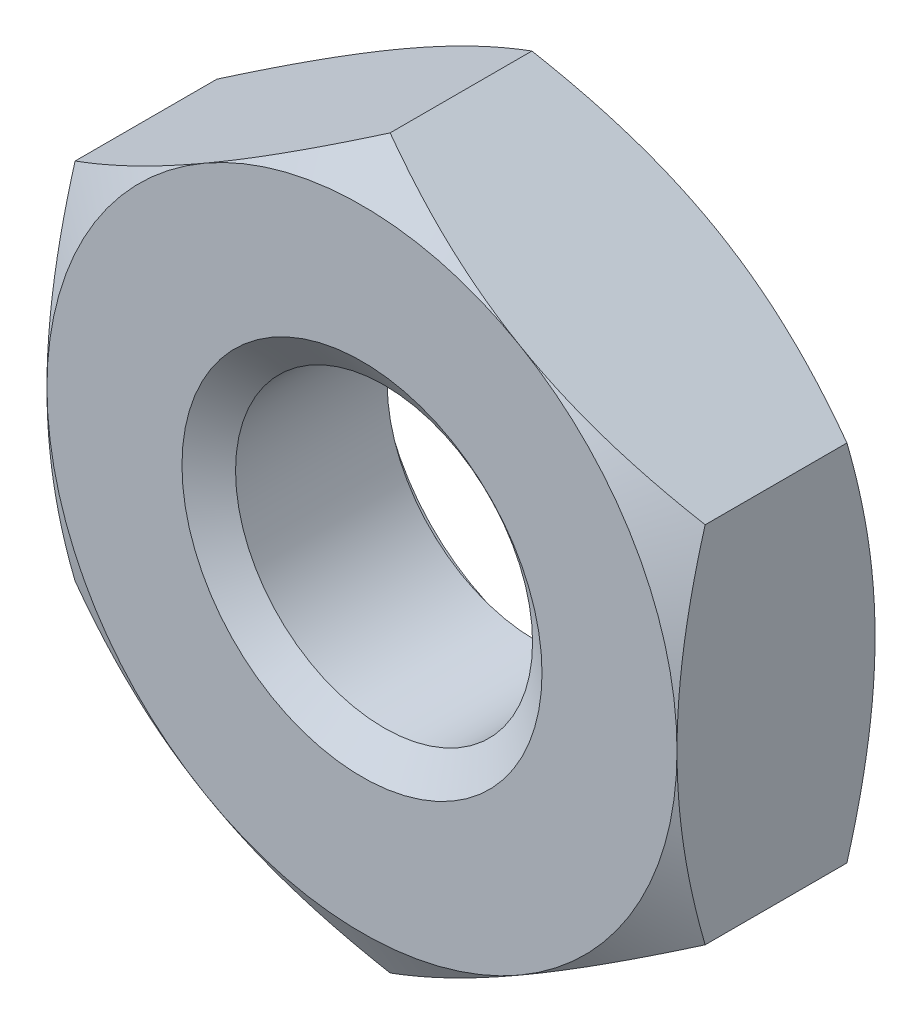
ISO-10303-21;
HEADER;
FILE_DESCRIPTION(('STEP AP214'),'2;1');
FILE_NAME('part.step','',(''),(''),'','','');
FILE_SCHEMA(('AUTOMOTIVE_DESIGN { 1 0 10303 214 1 1 1 1 }'));
ENDSEC;
DATA;
#1=APPLICATION_CONTEXT('core data for automotive mechanical design processes');
#2=APPLICATION_PROTOCOL_DEFINITION('international standard','automotive_design',2000,#1);
#3=PRODUCT_CONTEXT('',#1,'mechanical');
#4=PRODUCT('Part','Part','',(#3));
#5=PRODUCT_RELATED_PRODUCT_CATEGORY('part','',(#4));
#6=PRODUCT_DEFINITION_FORMATION('','',#4);
#7=PRODUCT_DEFINITION_CONTEXT('part definition',#1,'design');
#8=PRODUCT_DEFINITION('design','',#6,#7);
#9=PRODUCT_DEFINITION_SHAPE('','',#8);
#10=(LENGTH_UNIT() NAMED_UNIT(*) SI_UNIT(.MILLI.,.METRE.));
#11=(NAMED_UNIT(*) PLANE_ANGLE_UNIT() SI_UNIT($,.RADIAN.));
#12=(NAMED_UNIT(*) SI_UNIT($,.STERADIAN.) SOLID_ANGLE_UNIT());
#13=UNCERTAINTY_MEASURE_WITH_UNIT(LENGTH_MEASURE(1.E-05),#10,'distance_accuracy_value','');
#14=(GEOMETRIC_REPRESENTATION_CONTEXT(3) GLOBAL_UNCERTAINTY_ASSIGNED_CONTEXT((#13)) GLOBAL_UNIT_ASSIGNED_CONTEXT((#10,
#11,#12)) REPRESENTATION_CONTEXT('',''));
#15=CARTESIAN_POINT('',(0.,0.,0.));
#16=DIRECTION('',(0.,0.,1.));
#17=DIRECTION('',(1.,0.,0.));
#18=AXIS2_PLACEMENT_3D('',#15,#16,#17);
#19=CARTESIAN_POINT('',(0.,0.,-2.2));
#20=DIRECTION('',(0.,0.,1.));
#21=DIRECTION('',(1.,0.,0.));
#22=AXIS2_PLACEMENT_3D('',#19,#20,#21);
#23=CYLINDRICAL_SURFACE('',#22,1.65);
#24=CARTESIAN_POINT('',(0.,0.,-0.245072638373396));
#25=DIRECTION('',(0.,0.,1.));
#26=DIRECTION('',(1.,0.,0.));
#27=AXIS2_PLACEMENT_3D('',#24,#25,#26);
#28=CIRCLE('',#27,1.65);
#29=CARTESIAN_POINT('',(1.65,0.,-0.245072638373396));
#30=VERTEX_POINT('',#29);
#31=EDGE_CURVE('E175',#30,#30,#28,.F.);
#32=ORIENTED_EDGE('',*,*,#31,.F.);
#33=EDGE_LOOP('',(#32));
#34=FACE_BOUND('',#33,.T.);
#35=CARTESIAN_POINT('',(0.,0.,-1.9295273616266));
#36=DIRECTION('',(0.,0.,-1.));
#37=DIRECTION('',(-1.,0.,0.));
#38=AXIS2_PLACEMENT_3D('',#35,#36,#37);
#39=CIRCLE('',#38,1.65);
#40=CARTESIAN_POINT('',(-1.65,0.,-1.9295273616266));
#41=VERTEX_POINT('',#40);
#42=EDGE_CURVE('E40',#41,#41,#39,.F.);
#43=ORIENTED_EDGE('',*,*,#42,.F.);
#44=EDGE_LOOP('',(#43));
#45=FACE_BOUND('',#44,.T.);
#46=ADVANCED_FACE('F35',(#34,#45),#23,.F.);
#47=CARTESIAN_POINT('',(0.,4.04145188432739,-2.2));
#48=DIRECTION('',(0.,0.,-1.));
#49=DIRECTION('',(-1.,0.,0.));
#50=AXIS2_PLACEMENT_3D('',#47,#48,#49);
#51=PLANE('',#50);
#52=CARTESIAN_POINT('',(0.,0.,-2.2));
#53=DIRECTION('',(0.,0.,-1.));
#54=DIRECTION('',(-1.,0.,0.));
#55=AXIS2_PLACEMENT_3D('',#52,#53,#54);
#56=CIRCLE('',#55,3.5);
#57=CARTESIAN_POINT('',(-3.5,0.,-2.2));
#58=VERTEX_POINT('',#57);
#59=CARTESIAN_POINT('',(-1.75000000000002,-3.03108891324552,-2.2));
#60=VERTEX_POINT('',#59);
#61=EDGE_CURVE('E171',#58,#60,#56,.F.);
#62=ORIENTED_EDGE('',*,*,#61,.F.);
#63=CARTESIAN_POINT('',(-1.75000000000001,3.03108891324553,-2.2));
#64=VERTEX_POINT('',#63);
#65=EDGE_CURVE('E153',#64,#58,#56,.F.);
#66=ORIENTED_EDGE('',*,*,#65,.F.);
#67=CARTESIAN_POINT('',(1.75000000000002,3.03108891324552,-2.2));
#68=VERTEX_POINT('',#67);
#69=EDGE_CURVE('E170',#68,#64,#56,.F.);
#70=ORIENTED_EDGE('',*,*,#69,.F.);
#71=CARTESIAN_POINT('',(0.,0.,-2.2));
#72=DIRECTION('',(0.,0.,1.));
#73=DIRECTION('',(1.,0.,0.));
#74=AXIS2_PLACEMENT_3D('',#71,#72,#73);
#75=CIRCLE('',#74,3.5);
#76=CARTESIAN_POINT('',(3.5,0.,-2.2));
#77=VERTEX_POINT('',#76);
#78=EDGE_CURVE('E245',#77,#68,#75,.T.);
#79=ORIENTED_EDGE('',*,*,#78,.F.);
#80=CARTESIAN_POINT('',(1.75000000000001,-3.03108891324553,-2.2));
#81=VERTEX_POINT('',#80);
#82=EDGE_CURVE('E361',#81,#77,#56,.F.);
#83=ORIENTED_EDGE('',*,*,#82,.F.);
#84=EDGE_CURVE('E365',#60,#81,#56,.F.);
#85=ORIENTED_EDGE('',*,*,#84,.F.);
#86=EDGE_LOOP('',(#62,#66,#70,#79,#83,#85));
#87=FACE_BOUND('',#86,.T.);
#88=CARTESIAN_POINT('',(0.,0.,-2.2));
#89=DIRECTION('',(0.,0.,-1.));
#90=DIRECTION('',(-1.,0.,0.));
#91=AXIS2_PLACEMENT_3D('',#88,#89,#90);
#92=CIRCLE('',#91,2.);
#93=CARTESIAN_POINT('',(-2.,0.,-2.2));
#94=VERTEX_POINT('',#93);
#95=EDGE_CURVE('E178',#94,#94,#92,.F.);
#96=ORIENTED_EDGE('',*,*,#95,.T.);
#97=EDGE_LOOP('',(#96));
#98=FACE_BOUND('',#97,.T.);
#99=ADVANCED_FACE('F298',(#87,#98),#51,.T.);
#100=CARTESIAN_POINT('',(0.,4.04145188432739,0.));
#101=DIRECTION('',(0.,0.,-1.));
#102=DIRECTION('',(-1.,0.,0.));
#103=AXIS2_PLACEMENT_3D('',#100,#101,#102);
#104=PLANE('',#103);
#105=CARTESIAN_POINT('',(0.,0.,0.));
#106=DIRECTION('',(0.,0.,-1.));
#107=DIRECTION('',(-1.,0.,0.));
#108=AXIS2_PLACEMENT_3D('',#105,#106,#107);
#109=CIRCLE('',#108,3.5);
#110=CARTESIAN_POINT('',(-3.5,0.,0.));
#111=VERTEX_POINT('',#110);
#112=CARTESIAN_POINT('',(-1.75000000000001,3.03108891324553,0.));
#113=VERTEX_POINT('',#112);
#114=EDGE_CURVE('E11',#111,#113,#109,.T.);
#115=ORIENTED_EDGE('',*,*,#114,.F.);
#116=CARTESIAN_POINT('',(-1.75000000000002,-3.03108891324552,0.));
#117=VERTEX_POINT('',#116);
#118=EDGE_CURVE('E47',#117,#111,#109,.T.);
#119=ORIENTED_EDGE('',*,*,#118,.F.);
#120=CARTESIAN_POINT('',(1.75000000000001,-3.03108891324553,0.));
#121=VERTEX_POINT('',#120);
#122=EDGE_CURVE('E174',#121,#117,#109,.T.);
#123=ORIENTED_EDGE('',*,*,#122,.F.);
#124=CARTESIAN_POINT('',(3.5,0.,0.));
#125=VERTEX_POINT('',#124);
#126=EDGE_CURVE('E352',#125,#121,#109,.T.);
#127=ORIENTED_EDGE('',*,*,#126,.F.);
#128=CARTESIAN_POINT('',(0.,0.,0.));
#129=DIRECTION('',(0.,0.,1.));
#130=DIRECTION('',(1.,0.,0.));
#131=AXIS2_PLACEMENT_3D('',#128,#129,#130);
#132=CIRCLE('',#131,3.5);
#133=CARTESIAN_POINT('',(1.75000000000002,3.03108891324552,0.));
#134=VERTEX_POINT('',#133);
#135=EDGE_CURVE('E129',#125,#134,#132,.T.);
#136=ORIENTED_EDGE('',*,*,#135,.T.);
#137=EDGE_CURVE('E45',#113,#134,#109,.T.);
#138=ORIENTED_EDGE('',*,*,#137,.F.);
#139=EDGE_LOOP('',(#115,#119,#123,#127,#136,#138));
#140=FACE_BOUND('',#139,.T.);
#141=CARTESIAN_POINT('',(0.,0.,0.));
#142=DIRECTION('',(0.,0.,1.));
#143=DIRECTION('',(1.,0.,0.));
#144=AXIS2_PLACEMENT_3D('',#141,#142,#143);
#145=CIRCLE('',#144,2.);
#146=CARTESIAN_POINT('',(2.,0.,0.));
#147=VERTEX_POINT('',#146);
#148=EDGE_CURVE('E177',#147,#147,#145,.T.);
#149=ORIENTED_EDGE('',*,*,#148,.F.);
#150=EDGE_LOOP('',(#149));
#151=FACE_BOUND('',#150,.T.);
#152=ADVANCED_FACE('F250',(#140,#151),#104,.F.);
#153=CARTESIAN_POINT('',(0.,4.04145188432739,-2.2));
#154=DIRECTION('',(-0.500000000000003,0.866025403784437,0.));
#155=DIRECTION('',(-0.866025403784437,-0.500000000000003,0.));
#156=AXIS2_PLACEMENT_3D('',#153,#154,#155);
#157=PLANE('',#156);
#158=DIRECTION('',(0.,0.,1.));
#159=VECTOR('',#158,1.);
#160=CARTESIAN_POINT('',(-3.5,2.02072594216368,-2.2));
#161=LINE('',#160,#159);
#162=CARTESIAN_POINT('',(-3.5,2.02072594216372,-1.88739260883035));
#163=VERTEX_POINT('',#162);
#164=CARTESIAN_POINT('',(-3.5,2.02072594216368,-0.312607391169644));
#165=VERTEX_POINT('',#164);
#166=EDGE_CURVE('E165',#163,#165,#161,.T.);
#167=ORIENTED_EDGE('',*,*,#166,.T.);
#168=CARTESIAN_POINT('',(-3.5002,2.02061047210984,-0.312674060693373));
#169=CARTESIAN_POINT('',(-3.34639282154755,2.10941108799266,-0.261385788989984));
#170=CARTESIAN_POINT('',(-3.19125798916558,2.19897822522908,-0.214740953816197));
#171=CARTESIAN_POINT('',(-2.87830199342322,2.37966345361544,-0.133321875533348));
#172=CARTESIAN_POINT('',(-2.7204752692125,2.47078475532382,-0.0985764355845608));
#173=CARTESIAN_POINT('',(-2.40677778961987,2.65189807961073,-0.0444900271828354));
#174=CARTESIAN_POINT('',(-2.25095530083931,2.74186223545399,-0.0247890862603808));
#175=CARTESIAN_POINT('',(-1.93857711279463,2.92221386641055,-0.00127013273725375));
#176=CARTESIAN_POINT('',(-1.78202254896577,3.01260068598001,0.00256735545443527));
#177=CARTESIAN_POINT('',(-1.48949078007901,3.1814939814933,-0.00541530187697797));
#178=CARTESIAN_POINT('',(-1.35346978754209,3.26002573814993,-0.0152754340696081));
#179=CARTESIAN_POINT('',(-1.082313979711,3.41657761679354,-0.0465264668994061));
#180=CARTESIAN_POINT('',(-0.947180102315315,3.49459719728458,-0.0679280432858016));
#181=CARTESIAN_POINT('',(-0.675465207594812,3.65147186489429,-0.121430407880583));
#182=CARTESIAN_POINT('',(-0.538918580721659,3.73030709667644,-0.153757994445094));
#183=CARTESIAN_POINT('',(-0.267861907055491,3.88680174018325,-0.227128933808004));
#184=CARTESIAN_POINT('',(-0.133348387531455,3.9644631568901,-0.268155046569877));
#185=CARTESIAN_POINT('',(0.000200000000008977,4.04156735438123,-0.312674060693383));
#186=B_SPLINE_CURVE_WITH_KNOTS('',3,(#168,#169,#170,#171,#172,#173,#174,#175,#176,#177,#178,
#179,#180,#181,#182,#183,#184,#185),.UNSPECIFIED.,.F.,.F.,(4,2,2,2,2,2,2,2,4),(0.,
0.554793832886255,1.11092123814984,1.65328467083219,2.19498204478403,2.66665130850861,
3.13875761298268,3.62133612600511,4.10296698719189),.UNSPECIFIED.);
#187=EDGE_CURVE('E134',#165,#113,#186,.T.);
#188=ORIENTED_EDGE('',*,*,#187,.T.);
#189=CARTESIAN_POINT('',(0.,4.04145188432739,-0.312607391169655));
#190=VERTEX_POINT('',#189);
#191=EDGE_CURVE('E54',#113,#190,#186,.T.);
#192=ORIENTED_EDGE('',*,*,#191,.T.);
#193=DIRECTION('',(0.,0.,1.));
#194=VECTOR('',#193,1.);
#195=CARTESIAN_POINT('',(0.,4.04145188432739,-2.2));
#196=LINE('',#195,#194);
#197=CARTESIAN_POINT('',(0.,4.04145188432739,-1.88739260883035));
#198=VERTEX_POINT('',#197);
#199=EDGE_CURVE('E150',#198,#190,#196,.T.);
#200=ORIENTED_EDGE('',*,*,#199,.F.);
#201=CARTESIAN_POINT('',(-3.5002,2.02061047210984,-1.88732593930663));
#202=CARTESIAN_POINT('',(-3.34639282154755,2.10941108799266,-1.93861421101002));
#203=CARTESIAN_POINT('',(-3.19125798916558,2.19897822522908,-1.9852590461838));
#204=CARTESIAN_POINT('',(-2.87830199342322,2.37966345361544,-2.06667812446665));
#205=CARTESIAN_POINT('',(-2.7204752692125,2.47078475532382,-2.10142356441544));
#206=CARTESIAN_POINT('',(-2.40677778961987,2.65189807961073,-2.15550997281717));
#207=CARTESIAN_POINT('',(-2.25095530083931,2.74186223545399,-2.17521091373962));
#208=CARTESIAN_POINT('',(-1.93857711279463,2.92221386641055,-2.19872986726275));
#209=CARTESIAN_POINT('',(-1.78202254896577,3.01260068598001,-2.20256735545444));
#210=CARTESIAN_POINT('',(-1.48949078007901,3.1814939814933,-2.19458469812302));
#211=CARTESIAN_POINT('',(-1.35346978754209,3.26002573814993,-2.18472456593039));
#212=CARTESIAN_POINT('',(-1.082313979711,3.41657761679354,-2.15347353310059));
#213=CARTESIAN_POINT('',(-0.947180102315315,3.49459719728458,-2.1320719567142));
#214=CARTESIAN_POINT('',(-0.675465207594812,3.65147186489429,-2.07856959211942));
#215=CARTESIAN_POINT('',(-0.538918580721659,3.73030709667644,-2.04624200555491));
#216=CARTESIAN_POINT('',(-0.267861907055491,3.88680174018325,-1.972871066192));
#217=CARTESIAN_POINT('',(-0.133348387531455,3.9644631568901,-1.93184495343012));
#218=CARTESIAN_POINT('',(0.000200000000009136,4.04156735438123,-1.88732593930662));
#219=B_SPLINE_CURVE_WITH_KNOTS('',3,(#201,#202,#203,#204,#205,#206,#207,#208,#209,#210,#211,
#212,#213,#214,#215,#216,#217,#218),.UNSPECIFIED.,.F.,.F.,(4,2,2,2,2,2,2,2,4),(0.,
0.554793832886255,1.11092123814984,1.65328467083219,2.19498204478403,2.66665130850861,
3.13875761298268,3.62133612600511,4.10296698719189),.UNSPECIFIED.);
#220=EDGE_CURVE('E168',#64,#198,#219,.T.);
#221=ORIENTED_EDGE('',*,*,#220,.F.);
#222=EDGE_CURVE('E260',#163,#64,#219,.T.);
#223=ORIENTED_EDGE('',*,*,#222,.F.);
#224=EDGE_LOOP('',(#167,#188,#192,#200,#221,#223));
#225=FACE_BOUND('',#224,.T.);
#226=ADVANCED_FACE('F37',(#225),#157,.T.);
#227=CARTESIAN_POINT('',(3.5,2.02072594216367,-2.2));
#228=DIRECTION('',(0.500000000000007,0.866025403784435,0.));
#229=DIRECTION('',(-0.866025403784435,0.500000000000007,0.));
#230=AXIS2_PLACEMENT_3D('',#227,#228,#229);
#231=PLANE('',#230);
#232=ORIENTED_EDGE('',*,*,#199,.T.);
#233=CARTESIAN_POINT('',(-0.000199999999990868,4.04156735438123,-0.312674060693383));
#234=CARTESIAN_POINT('',(0.153607178452459,3.95276673849841,-0.261385788989994));
#235=CARTESIAN_POINT('',(0.308742010834433,3.86319960126199,-0.214740953816206));
#236=CARTESIAN_POINT('',(0.621698006576791,3.68251437287563,-0.133321875533355));
#237=CARTESIAN_POINT('',(0.779524730787505,3.59139307116725,-0.0985764355845671));
#238=CARTESIAN_POINT('',(1.09322221038014,3.41027974688034,-0.0444900271828396));
#239=CARTESIAN_POINT('',(1.2490446991607,3.32031559103708,-0.024789086260384));
#240=CARTESIAN_POINT('',(1.56142288720538,3.13996396008051,-0.00127013273725514));
#241=CARTESIAN_POINT('',(1.71797745103424,3.04957714051106,0.00256735545443454));
#242=CARTESIAN_POINT('',(2.010509219921,2.88068384499776,-0.00541530187697728));
#243=CARTESIAN_POINT('',(2.14653021245792,2.80215208834113,-0.0152754340696065));
#244=CARTESIAN_POINT('',(2.417686020289,2.64560020969752,-0.0465264668994028));
#245=CARTESIAN_POINT('',(2.55281989768469,2.56758062920648,-0.0679280432857974));
#246=CARTESIAN_POINT('',(2.82453479240519,2.41070596159677,-0.121430407880576));
#247=CARTESIAN_POINT('',(2.96108141927834,2.33187072981462,-0.153757994445086));
#248=CARTESIAN_POINT('',(3.23213809294451,2.17537608630781,-0.227128933807994));
#249=CARTESIAN_POINT('',(3.36665161246854,2.09771466960096,-0.268155046569867));
#250=CARTESIAN_POINT('',(3.5002,2.02061047210983,-0.312674060693371));
#251=B_SPLINE_CURVE_WITH_KNOTS('',3,(#233,#234,#235,#236,#237,#238,#239,#240,#241,#242,#243,
#244,#245,#246,#247,#248,#249,#250),.UNSPECIFIED.,.F.,.F.,(4,2,2,2,2,2,2,2,4),(0.,
0.554793832886257,1.11092123814984,1.6532846708322,2.19498204478404,2.66665130850861,
3.13875761298268,3.62133612600511,4.10296698719189),.UNSPECIFIED.);
#252=EDGE_CURVE('E144',#190,#134,#251,.T.);
#253=ORIENTED_EDGE('',*,*,#252,.T.);
#254=CARTESIAN_POINT('',(3.5,2.02072594216371,-0.312607391169655));
#255=VERTEX_POINT('',#254);
#256=EDGE_CURVE('E61',#134,#255,#251,.T.);
#257=ORIENTED_EDGE('',*,*,#256,.T.);
#258=DIRECTION('',(0.,0.,1.));
#259=VECTOR('',#258,1.);
#260=CARTESIAN_POINT('',(3.5,2.02072594216367,-2.2));
#261=LINE('',#260,#259);
#262=CARTESIAN_POINT('',(3.5,2.02072594216371,-1.88739260883035));
#263=VERTEX_POINT('',#262);
#264=EDGE_CURVE('E143',#263,#255,#261,.T.);
#265=ORIENTED_EDGE('',*,*,#264,.F.);
#266=CARTESIAN_POINT('',(-0.000199999999990853,4.04156735438123,-1.88732593930662));
#267=CARTESIAN_POINT('',(0.153607178452459,3.95276673849841,-1.93861421101001));
#268=CARTESIAN_POINT('',(0.308742010834433,3.86319960126199,-1.98525904618379));
#269=CARTESIAN_POINT('',(0.621698006576791,3.68251437287563,-2.06667812446665));
#270=CARTESIAN_POINT('',(0.779524730787505,3.59139307116725,-2.10142356441543));
#271=CARTESIAN_POINT('',(1.09322221038014,3.41027974688034,-2.15550997281716));
#272=CARTESIAN_POINT('',(1.2490446991607,3.32031559103708,-2.17521091373962));
#273=CARTESIAN_POINT('',(1.56142288720538,3.13996396008051,-2.19872986726275));
#274=CARTESIAN_POINT('',(1.71797745103424,3.04957714051106,-2.20256735545444));
#275=CARTESIAN_POINT('',(2.010509219921,2.88068384499776,-2.19458469812302));
#276=CARTESIAN_POINT('',(2.14653021245792,2.80215208834113,-2.18472456593039));
#277=CARTESIAN_POINT('',(2.417686020289,2.64560020969752,-2.1534735331006));
#278=CARTESIAN_POINT('',(2.55281989768469,2.56758062920648,-2.1320719567142));
#279=CARTESIAN_POINT('',(2.82453479240519,2.41070596159677,-2.07856959211942));
#280=CARTESIAN_POINT('',(2.96108141927834,2.33187072981462,-2.04624200555491));
#281=CARTESIAN_POINT('',(3.23213809294451,2.17537608630781,-1.97287106619201));
#282=CARTESIAN_POINT('',(3.36665161246854,2.09771466960096,-1.93184495343013));
#283=CARTESIAN_POINT('',(3.5002,2.02061047210983,-1.88732593930663));
#284=B_SPLINE_CURVE_WITH_KNOTS('',3,(#266,#267,#268,#269,#270,#271,#272,#273,#274,#275,#276,
#277,#278,#279,#280,#281,#282,#283),.UNSPECIFIED.,.F.,.F.,(4,2,2,2,2,2,2,2,4),(0.,
0.554793832886257,1.11092123814984,1.6532846708322,2.19498204478404,2.66665130850861,
3.13875761298269,3.62133612600511,4.10296698719189),.UNSPECIFIED.);
#285=EDGE_CURVE('E254',#68,#263,#284,.T.);
#286=ORIENTED_EDGE('',*,*,#285,.F.);
#287=EDGE_CURVE('E259',#198,#68,#284,.T.);
#288=ORIENTED_EDGE('',*,*,#287,.F.);
#289=EDGE_LOOP('',(#232,#253,#257,#265,#286,#288));
#290=FACE_BOUND('',#289,.T.);
#291=ADVANCED_FACE('F141',(#290),#231,.T.);
#292=CARTESIAN_POINT('',(3.5,2.02072594216367,-2.2));
#293=DIRECTION('',(-1.,0.,0.));
#294=DIRECTION('',(0.,0.,1.));
#295=AXIS2_PLACEMENT_3D('',#292,#293,#294);
#296=PLANE('',#295);
#297=CARTESIAN_POINT('',(3.5,-5.35926299121409,-1.6748434685856));
#298=CARTESIAN_POINT('',(3.5,-5.20559319908845,-1.60058173692107));
#299=CARTESIAN_POINT('',(3.5,-5.05156008083379,-1.52705822833151));
#300=CARTESIAN_POINT('',(3.5,-4.74257074180714,-1.38190950344755));
#301=CARTESIAN_POINT('',(3.5,-4.5876143668244,-1.31028461582136));
#302=CARTESIAN_POINT('',(3.5,-4.27574500225546,-1.16897765517627));
#303=CARTESIAN_POINT('',(3.5,-4.11882589028195,-1.09930904568019));
#304=CARTESIAN_POINT('',(3.5,-3.80369792903859,-0.962964262242787));
#305=CARTESIAN_POINT('',(3.5,-3.64548914750599,-0.896287932319544));
#306=CARTESIAN_POINT('',(3.5,-3.32556618401859,-0.765931819095091));
#307=CARTESIAN_POINT('',(3.5,-3.16383281219927,-0.702298873688887));
#308=CARTESIAN_POINT('',(3.5,-2.83845840945601,-0.580016702089512));
#309=CARTESIAN_POINT('',(3.5,-2.67481716858829,-0.521368030370709));
#310=CARTESIAN_POINT('',(3.5,-2.34570278472052,-0.410630279877037));
#311=CARTESIAN_POINT('',(3.5,-2.18023438248745,-0.358527255435872));
#312=CARTESIAN_POINT('',(3.5,-1.84694522806372,-0.262572936976455));
#313=CARTESIAN_POINT('',(3.5,-1.67912523787533,-0.218719033467169));
#314=CARTESIAN_POINT('',(3.5,-1.34101828610927,-0.141391945584795));
#315=CARTESIAN_POINT('',(3.5,-1.17073068027696,-0.10792152521198));
#316=CARTESIAN_POINT('',(3.5,-0.828102385138508,-0.0536149564320562));
#317=CARTESIAN_POINT('',(3.5,-0.655761694017325,-0.0327788191952412));
#318=CARTESIAN_POINT('',(3.5,-0.311020490924471,-0.00558408650575978));
#319=CARTESIAN_POINT('',(3.5,-0.13862739720728,0.00086616316590878));
#320=CARTESIAN_POINT('',(3.5,0.206038074906516,-0.00105355807794762));
#321=CARTESIAN_POINT('',(3.5,0.378310473023162,-0.00941968196343303));
#322=CARTESIAN_POINT('',(3.5,0.672490555822308,-0.0357688927868924));
#323=CARTESIAN_POINT('',(3.5,0.794722791084071,-0.0503206340384211));
#324=CARTESIAN_POINT('',(3.5,1.03824305430558,-0.0859367340533544));
#325=CARTESIAN_POINT('',(3.5,1.15953093025884,-0.107002119926139));
#326=CARTESIAN_POINT('',(3.5,1.52187914771345,-0.178863187081449));
#327=CARTESIAN_POINT('',(3.5,1.76124104212628,-0.238305275622005));
#328=CARTESIAN_POINT('',(3.5,2.11940971387704,-0.340826814402547));
#329=CARTESIAN_POINT('',(3.5,2.24008344316342,-0.377749699085174));
#330=CARTESIAN_POINT('',(3.5,2.48017139213723,-0.455249007699283));
#331=CARTESIAN_POINT('',(3.5,2.59958641795608,-0.495822911663539));
#332=CARTESIAN_POINT('',(3.5,2.83665760451793,-0.57977998678274));
#333=CARTESIAN_POINT('',(3.5,2.95431988203478,-0.623146060034301));
#334=CARTESIAN_POINT('',(3.5,3.18873153508794,-0.712423559566851));
#335=CARTESIAN_POINT('',(3.5,3.30548051959458,-0.758336014592935));
#336=CARTESIAN_POINT('',(3.5,3.42180736613342,-0.805270380724054));
#337=B_SPLINE_CURVE_WITH_KNOTS('',3,(#297,#298,#299,#300,#301,#302,#303,#304,#305,#306,#307,
#308,#309,#310,#311,#312,#313,#314,#315,#316,#317,#318,#319,#320,#321,#322,#323,#324,#325,#326,
#327,#328,#329,#330,#331,#332,#333,#334,#335,#336),.UNSPECIFIED.,.F.,.F.,(4,2,2,2,2,2,2,2,2,2,2,
2,2,2,2,2,2,2,2,4),(0.,0.512025318465739,1.02413870177436,1.53918270315241,2.05419982499224,
2.57553975872799,3.09693761309354,3.61720506610402,4.13730766217539,4.65754858684367,
5.17778997146964,5.69470725122285,6.21149033452403,6.58059623222333,6.94976036239486,
7.68863804939851,8.06719621660478,8.44549507476759,8.82166461280097,9.19798724733408),.UNSPECIFIED.);
#338=CARTESIAN_POINT('',(3.49999999999999,-2.02072594216373,-0.312607391169655));
#339=VERTEX_POINT('',#338);
#340=EDGE_CURVE('E136',#339,#125,#337,.T.);
#341=ORIENTED_EDGE('',*,*,#340,.F.);
#342=DIRECTION('',(0.,0.,1.));
#343=VECTOR('',#342,1.);
#344=CARTESIAN_POINT('',(3.5,-2.02072594216372,-2.2));
#345=LINE('',#344,#343);
#346=CARTESIAN_POINT('',(3.49999999999999,-2.02072594216373,-1.88739260883035));
#347=VERTEX_POINT('',#346);
#348=EDGE_CURVE('E151',#347,#339,#345,.T.);
#349=ORIENTED_EDGE('',*,*,#348,.F.);
#350=CARTESIAN_POINT('',(3.5,-5.35926299121409,-0.525156531414403));
#351=CARTESIAN_POINT('',(3.5,-5.20559319908845,-0.599418263078928));
#352=CARTESIAN_POINT('',(3.5,-5.05156008083379,-0.672941771668492));
#353=CARTESIAN_POINT('',(3.5,-4.74257074180714,-0.818090496552449));
#354=CARTESIAN_POINT('',(3.5,-4.5876143668244,-0.889715384178641));
#355=CARTESIAN_POINT('',(3.5,-4.27574500225546,-1.03102234482373));
#356=CARTESIAN_POINT('',(3.5,-4.11882589028195,-1.10069095431981));
#357=CARTESIAN_POINT('',(3.5,-3.80369792903859,-1.23703573775721));
#358=CARTESIAN_POINT('',(3.5,-3.64548914750599,-1.30371206768046));
#359=CARTESIAN_POINT('',(3.5,-3.32556618401859,-1.43406818090491));
#360=CARTESIAN_POINT('',(3.5,-3.16383281219927,-1.49770112631111));
#361=CARTESIAN_POINT('',(3.5,-2.838458409456,-1.61998329791049));
#362=CARTESIAN_POINT('',(3.5,-2.67481716858829,-1.67863196962929));
#363=CARTESIAN_POINT('',(3.5,-2.34570278472052,-1.78936972012296));
#364=CARTESIAN_POINT('',(3.5,-2.18023438248745,-1.84147274456413));
#365=CARTESIAN_POINT('',(3.5,-1.84694522806372,-1.93742706302355));
#366=CARTESIAN_POINT('',(3.5,-1.67912523787533,-1.98128096653283));
#367=CARTESIAN_POINT('',(3.5,-1.34101828610927,-2.0586080544152));
#368=CARTESIAN_POINT('',(3.5,-1.17073068027696,-2.09207847478802));
#369=CARTESIAN_POINT('',(3.5,-0.828102385138508,-2.14638504356794));
#370=CARTESIAN_POINT('',(3.5,-0.655761694017324,-2.16722118080476));
#371=CARTESIAN_POINT('',(3.5,-0.31102049092447,-2.19441591349424));
#372=CARTESIAN_POINT('',(3.5,-0.13862739720728,-2.20086616316591));
#373=CARTESIAN_POINT('',(3.5,0.206038074906517,-2.19894644192205));
#374=CARTESIAN_POINT('',(3.5,0.378310473023162,-2.19058031803657));
#375=CARTESIAN_POINT('',(3.5,0.672490555822308,-2.16423110721311));
#376=CARTESIAN_POINT('',(3.5,0.794722791084071,-2.14967936596158));
#377=CARTESIAN_POINT('',(3.5,1.03824305430558,-2.11406326594665));
#378=CARTESIAN_POINT('',(3.5,1.15953093025884,-2.09299788007386));
#379=CARTESIAN_POINT('',(3.5,1.52187914771345,-2.02113681291855));
#380=CARTESIAN_POINT('',(3.5,1.76124104212628,-1.961694724378));
#381=CARTESIAN_POINT('',(3.5,2.11940971387704,-1.85917318559745));
#382=CARTESIAN_POINT('',(3.5,2.24008344316342,-1.82225030091483));
#383=CARTESIAN_POINT('',(3.5,2.48017139213724,-1.74475099230072));
#384=CARTESIAN_POINT('',(3.5,2.59958641795608,-1.70417708833646));
#385=CARTESIAN_POINT('',(3.5,2.83665760451793,-1.62022001321726));
#386=CARTESIAN_POINT('',(3.5,2.95431988203478,-1.5768539399657));
#387=CARTESIAN_POINT('',(3.5,3.18873153508794,-1.48757644043315));
#388=CARTESIAN_POINT('',(3.5,3.30548051959458,-1.44166398540707));
#389=CARTESIAN_POINT('',(3.5,3.42180736613342,-1.39472961927595));
#390=B_SPLINE_CURVE_WITH_KNOTS('',3,(#350,#351,#352,#353,#354,#355,#356,#357,#358,#359,#360,
#361,#362,#363,#364,#365,#366,#367,#368,#369,#370,#371,#372,#373,#374,#375,#376,#377,#378,#379,
#380,#381,#382,#383,#384,#385,#386,#387,#388,#389),.UNSPECIFIED.,.F.,.F.,(4,2,2,2,2,2,2,2,2,2,2,
2,2,2,2,2,2,2,2,4),(0.,0.512025318465739,1.02413870177436,1.53918270315241,2.05419982499224,
2.57553975872799,3.09693761309354,3.61720506610402,4.13730766217539,4.65754858684367,
5.17778997146964,5.69470725122285,6.21149033452403,6.58059623222333,6.94976036239486,
7.68863804939851,8.06719621660478,8.4454950747676,8.82166461280098,9.19798724733409),.UNSPECIFIED.);
#391=EDGE_CURVE('E266',#347,#77,#390,.T.);
#392=ORIENTED_EDGE('',*,*,#391,.T.);
#393=EDGE_CURVE('E149',#77,#263,#390,.T.);
#394=ORIENTED_EDGE('',*,*,#393,.T.);
#395=ORIENTED_EDGE('',*,*,#264,.T.);
#396=EDGE_CURVE('E126',#125,#255,#337,.T.);
#397=ORIENTED_EDGE('',*,*,#396,.F.);
#398=EDGE_LOOP('',(#341,#349,#392,#394,#395,#397));
#399=FACE_BOUND('',#398,.T.);
#400=ADVANCED_FACE('F147',(#399),#296,.F.);
#401=CARTESIAN_POINT('',(0.,-4.04145188432744,-2.2));
#402=DIRECTION('',(0.500000000000004,-0.866025403784437,0.));
#403=DIRECTION('',(0.866025403784437,0.500000000000004,0.));
#404=AXIS2_PLACEMENT_3D('',#401,#402,#403);
#405=PLANE('',#404);
#406=ORIENTED_EDGE('',*,*,#348,.T.);
#407=CARTESIAN_POINT('',(3.5002,-2.02061047210988,-0.312674060693386));
#408=CARTESIAN_POINT('',(3.34639282154755,-2.1094110879927,-0.261385788989998));
#409=CARTESIAN_POINT('',(3.19125798916558,-2.19897822522913,-0.214740953816212));
#410=CARTESIAN_POINT('',(2.87830199342322,-2.37966345361549,-0.133321875533364));
#411=CARTESIAN_POINT('',(2.7204752692125,-2.47078475532386,-0.0985764355845776));
#412=CARTESIAN_POINT('',(2.40677778961987,-2.65189807961078,-0.0444900271828536));
#413=CARTESIAN_POINT('',(2.2509553008393,-2.74186223545403,-0.0247890862603998));
#414=CARTESIAN_POINT('',(1.93857711279462,-2.9222138664106,-0.00127013273727486));
#415=CARTESIAN_POINT('',(1.78202254896576,-3.01260068598006,0.00256735545441282));
#416=CARTESIAN_POINT('',(1.489490780079,-3.18149398149335,-0.00541530187700228));
#417=CARTESIAN_POINT('',(1.35346978754209,-3.26002573814998,-0.0152754340696328));
#418=CARTESIAN_POINT('',(1.082313979711,-3.41657761679359,-0.0465264668994314));
#419=CARTESIAN_POINT('',(0.947180102315313,-3.49459719728463,-0.0679280432858271));
#420=CARTESIAN_POINT('',(0.675465207594812,-3.65147186489434,-0.121430407880608));
#421=CARTESIAN_POINT('',(0.538918580721661,-3.73030709667649,-0.153757994445119));
#422=CARTESIAN_POINT('',(0.267861907055496,-3.8868017401833,-0.227128933808028));
#423=CARTESIAN_POINT('',(0.133348387531462,-3.96446315689014,-0.268155046569902));
#424=CARTESIAN_POINT('',(-0.000200000000001497,-4.04156735438127,-0.312674060693407));
#425=B_SPLINE_CURVE_WITH_KNOTS('',3,(#407,#408,#409,#410,#411,#412,#413,#414,#415,#416,#417,
#418,#419,#420,#421,#422,#423,#424),.UNSPECIFIED.,.F.,.F.,(4,2,2,2,2,2,2,2,4),(0.,
0.554793832886258,1.11092123814984,1.6532846708322,2.19498204478405,2.66665130850862,
3.13875761298269,3.62133612600511,4.10296698719189),.UNSPECIFIED.);
#426=EDGE_CURVE('E347',#339,#121,#425,.T.);
#427=ORIENTED_EDGE('',*,*,#426,.T.);
#428=CARTESIAN_POINT('',(0.,-4.04145188432739,-0.312607391169655));
#429=VERTEX_POINT('',#428);
#430=EDGE_CURVE('E226',#121,#429,#425,.T.);
#431=ORIENTED_EDGE('',*,*,#430,.T.);
#432=DIRECTION('',(0.,0.,1.));
#433=VECTOR('',#432,1.);
#434=CARTESIAN_POINT('',(0.,-4.04145188432744,-2.2));
#435=LINE('',#434,#433);
#436=CARTESIAN_POINT('',(0.,-4.04145188432739,-1.88739260883035));
#437=VERTEX_POINT('',#436);
#438=EDGE_CURVE('E156',#437,#429,#435,.T.);
#439=ORIENTED_EDGE('',*,*,#438,.F.);
#440=CARTESIAN_POINT('',(3.5002,-2.02061047210988,-1.88732593930661));
#441=CARTESIAN_POINT('',(3.34639282154755,-2.1094110879927,-1.93861421101));
#442=CARTESIAN_POINT('',(3.19125798916558,-2.19897822522913,-1.98525904618379));
#443=CARTESIAN_POINT('',(2.87830199342322,-2.37966345361549,-2.06667812446664));
#444=CARTESIAN_POINT('',(2.7204752692125,-2.47078475532386,-2.10142356441542));
#445=CARTESIAN_POINT('',(2.40677778961987,-2.65189807961078,-2.15550997281715));
#446=CARTESIAN_POINT('',(2.2509553008393,-2.74186223545404,-2.1752109137396));
#447=CARTESIAN_POINT('',(1.93857711279462,-2.9222138664106,-2.19872986726273));
#448=CARTESIAN_POINT('',(1.78202254896576,-3.01260068598006,-2.20256735545441));
#449=CARTESIAN_POINT('',(1.489490780079,-3.18149398149335,-2.194584698123));
#450=CARTESIAN_POINT('',(1.35346978754209,-3.26002573814998,-2.18472456593037));
#451=CARTESIAN_POINT('',(1.082313979711,-3.41657761679359,-2.15347353310057));
#452=CARTESIAN_POINT('',(0.947180102315312,-3.49459719728463,-2.13207195671417));
#453=CARTESIAN_POINT('',(0.675465207594812,-3.65147186489434,-2.07856959211939));
#454=CARTESIAN_POINT('',(0.538918580721661,-3.73030709667649,-2.04624200555488));
#455=CARTESIAN_POINT('',(0.267861907055496,-3.8868017401833,-1.97287106619197));
#456=CARTESIAN_POINT('',(0.133348387531462,-3.96446315689014,-1.9318449534301));
#457=CARTESIAN_POINT('',(-0.000200000000001495,-4.04156735438127,-1.88732593930659));
#458=B_SPLINE_CURVE_WITH_KNOTS('',3,(#440,#441,#442,#443,#444,#445,#446,#447,#448,#449,#450,
#451,#452,#453,#454,#455,#456,#457),.UNSPECIFIED.,.F.,.F.,(4,2,2,2,2,2,2,2,4),(0.,
0.554793832886258,1.11092123814985,1.6532846708322,2.19498204478405,2.66665130850862,
3.13875761298269,3.62133612600511,4.10296698719189),.UNSPECIFIED.);
#459=EDGE_CURVE('E272',#81,#437,#458,.T.);
#460=ORIENTED_EDGE('',*,*,#459,.F.);
#461=EDGE_CURVE('E271',#347,#81,#458,.T.);
#462=ORIENTED_EDGE('',*,*,#461,.F.);
#463=EDGE_LOOP('',(#406,#427,#431,#439,#460,#462));
#464=FACE_BOUND('',#463,.T.);
#465=ADVANCED_FACE('F282',(#464),#405,.T.);
#466=CARTESIAN_POINT('',(-3.5,-2.02072594216371,-2.2));
#467=DIRECTION('',(-0.500000000000006,-0.866025403784435,0.));
#468=DIRECTION('',(0.866025403784435,-0.500000000000006,0.));
#469=AXIS2_PLACEMENT_3D('',#466,#467,#468);
#470=PLANE('',#469);
#471=ORIENTED_EDGE('',*,*,#438,.T.);
#472=CARTESIAN_POINT('',(0.00019999999999873,-4.04156735438127,-0.312674060693407));
#473=CARTESIAN_POINT('',(-0.153607178452453,-3.95276673849845,-0.261385788990017));
#474=CARTESIAN_POINT('',(-0.308742010834428,-3.86319960126203,-0.214740953816229));
#475=CARTESIAN_POINT('',(-0.621698006576789,-3.68251437287567,-0.133321875533377));
#476=CARTESIAN_POINT('',(-0.779524730787505,-3.59139307116729,-0.0985764355845883));
#477=CARTESIAN_POINT('',(-1.09322221038014,-3.41027974688037,-0.04449002718286));
#478=CARTESIAN_POINT('',(-1.24904469916071,-3.32031559103712,-0.0247890862604039));
#479=CARTESIAN_POINT('',(-1.56142288720539,-3.13996396008055,-0.00127013273727451));
#480=CARTESIAN_POINT('',(-1.71797745103425,-3.04957714051109,0.00256735545441532));
#481=CARTESIAN_POINT('',(-2.01050921992101,-2.8806838449978,-0.00541530187699619));
#482=CARTESIAN_POINT('',(-2.14653021245792,-2.80215208834117,-0.015275434069625));
#483=CARTESIAN_POINT('',(-2.41768602028901,-2.64560020969756,-0.0465264668994202));
#484=CARTESIAN_POINT('',(-2.5528198976847,-2.56758062920652,-0.0679280432858143));
#485=CARTESIAN_POINT('',(-2.82453479240519,-2.41070596159681,-0.121430407880592));
#486=CARTESIAN_POINT('',(-2.96108141927834,-2.33187072981466,-0.153757994445101));
#487=CARTESIAN_POINT('',(-3.23213809294451,-2.17537608630785,-0.227128933808006));
#488=CARTESIAN_POINT('',(-3.36665161246854,-2.09771466960101,-0.268155046569878));
#489=CARTESIAN_POINT('',(-3.5002,-2.02061047210987,-0.312674060693382));
#490=B_SPLINE_CURVE_WITH_KNOTS('',3,(#472,#473,#474,#475,#476,#477,#478,#479,#480,#481,#482,
#483,#484,#485,#486,#487,#488,#489),.UNSPECIFIED.,.F.,.F.,(4,2,2,2,2,2,2,2,4),(0.,
0.554793832886262,1.11092123814985,1.65328467083221,2.19498204478407,2.66665130850863,
3.1387576129827,3.62133612600512,4.10296698719189),.UNSPECIFIED.);
#491=EDGE_CURVE('E345',#429,#117,#490,.T.);
#492=ORIENTED_EDGE('',*,*,#491,.T.);
#493=CARTESIAN_POINT('',(-3.5,-2.02072594216372,-0.312607391169655));
#494=VERTEX_POINT('',#493);
#495=EDGE_CURVE('E200',#117,#494,#490,.T.);
#496=ORIENTED_EDGE('',*,*,#495,.T.);
#497=DIRECTION('',(0.,0.,1.));
#498=VECTOR('',#497,1.);
#499=CARTESIAN_POINT('',(-3.5,-2.02072594216371,-2.2));
#500=LINE('',#499,#498);
#501=CARTESIAN_POINT('',(-3.5,-2.02072594216372,-1.88739260883035));
#502=VERTEX_POINT('',#501);
#503=EDGE_CURVE('E162',#502,#494,#500,.T.);
#504=ORIENTED_EDGE('',*,*,#503,.F.);
#505=CARTESIAN_POINT('',(0.00019999999999873,-4.04156735438127,-1.88732593930659));
#506=CARTESIAN_POINT('',(-0.153607178452452,-3.95276673849845,-1.93861421100998));
#507=CARTESIAN_POINT('',(-0.308742010834428,-3.86319960126203,-1.98525904618377));
#508=CARTESIAN_POINT('',(-0.621698006576789,-3.68251437287567,-2.06667812446662));
#509=CARTESIAN_POINT('',(-0.779524730787505,-3.59139307116729,-2.10142356441541));
#510=CARTESIAN_POINT('',(-1.09322221038014,-3.41027974688037,-2.15550997281714));
#511=CARTESIAN_POINT('',(-1.24904469916071,-3.32031559103712,-2.1752109137396));
#512=CARTESIAN_POINT('',(-1.56142288720539,-3.13996396008055,-2.19872986726273));
#513=CARTESIAN_POINT('',(-1.71797745103425,-3.04957714051109,-2.20256735545442));
#514=CARTESIAN_POINT('',(-2.01050921992101,-2.8806838449978,-2.194584698123));
#515=CARTESIAN_POINT('',(-2.14653021245792,-2.80215208834117,-2.18472456593038));
#516=CARTESIAN_POINT('',(-2.41768602028901,-2.64560020969756,-2.15347353310058));
#517=CARTESIAN_POINT('',(-2.5528198976847,-2.56758062920652,-2.13207195671419));
#518=CARTESIAN_POINT('',(-2.82453479240519,-2.41070596159681,-2.07856959211941));
#519=CARTESIAN_POINT('',(-2.96108141927834,-2.33187072981466,-2.0462420055549));
#520=CARTESIAN_POINT('',(-3.23213809294451,-2.17537608630785,-1.97287106619199));
#521=CARTESIAN_POINT('',(-3.36665161246854,-2.09771466960101,-1.93184495343012));
#522=CARTESIAN_POINT('',(-3.5002,-2.02061047210987,-1.88732593930662));
#523=B_SPLINE_CURVE_WITH_KNOTS('',3,(#505,#506,#507,#508,#509,#510,#511,#512,#513,#514,#515,
#516,#517,#518,#519,#520,#521,#522),.UNSPECIFIED.,.F.,.F.,(4,2,2,2,2,2,2,2,4),(0.,
0.554793832886262,1.11092123814985,1.65328467083221,2.19498204478406,2.66665130850863,
3.1387576129827,3.62133612600512,4.10296698719189),.UNSPECIFIED.);
#524=EDGE_CURVE('E278',#60,#502,#523,.T.);
#525=ORIENTED_EDGE('',*,*,#524,.F.);
#526=EDGE_CURVE('E277',#437,#60,#523,.T.);
#527=ORIENTED_EDGE('',*,*,#526,.F.);
#528=EDGE_LOOP('',(#471,#492,#496,#504,#525,#527));
#529=FACE_BOUND('',#528,.T.);
#530=ADVANCED_FACE('F285',(#529),#470,.T.);
#531=CARTESIAN_POINT('',(-3.5,2.02072594216368,-2.2));
#532=DIRECTION('',(-1.,0.,0.));
#533=DIRECTION('',(0.,0.,1.));
#534=AXIS2_PLACEMENT_3D('',#531,#532,#533);
#535=PLANE('',#534);
#536=ORIENTED_EDGE('',*,*,#503,.T.);
#537=CARTESIAN_POINT('',(-3.5,-5.35926299121408,-1.67484346858559));
#538=CARTESIAN_POINT('',(-3.5,-5.20559319908844,-1.60058173692106));
#539=CARTESIAN_POINT('',(-3.5,-5.05156008083377,-1.5270582283315));
#540=CARTESIAN_POINT('',(-3.5,-4.74257074180712,-1.38190950344754));
#541=CARTESIAN_POINT('',(-3.5,-4.58761436682439,-1.31028461582135));
#542=CARTESIAN_POINT('',(-3.5,-4.27574500225544,-1.16897765517626));
#543=CARTESIAN_POINT('',(-3.5,-4.11882589028194,-1.09930904568018));
#544=CARTESIAN_POINT('',(-3.5,-3.80369792903857,-0.96296426224278));
#545=CARTESIAN_POINT('',(-3.5,-3.64548914750597,-0.896287932319536));
#546=CARTESIAN_POINT('',(-3.5,-3.32556618401857,-0.765931819095083));
#547=CARTESIAN_POINT('',(-3.5,-3.16383281219926,-0.70229887368888));
#548=CARTESIAN_POINT('',(-3.5,-2.83845840945599,-0.580016702089506));
#549=CARTESIAN_POINT('',(-3.5,-2.67481716858828,-0.521368030370704));
#550=CARTESIAN_POINT('',(-3.5,-2.34570278472051,-0.410630279877032));
#551=CARTESIAN_POINT('',(-3.5,-2.18023438248744,-0.358527255435867));
#552=CARTESIAN_POINT('',(-3.5,-1.84694522806371,-0.262572936976451));
#553=CARTESIAN_POINT('',(-3.5,-1.67912523787532,-0.218719033467165));
#554=CARTESIAN_POINT('',(-3.5,-1.34101828610927,-0.141391945584792));
#555=CARTESIAN_POINT('',(-3.5,-1.17073068027695,-0.107921525211977));
#556=CARTESIAN_POINT('',(-3.5,-0.8281023851385,-0.0536149564320532));
#557=CARTESIAN_POINT('',(-3.5,-0.655761694017317,-0.0327788191952385));
#558=CARTESIAN_POINT('',(-3.5,-0.311020490924464,-0.00558408650575746));
#559=CARTESIAN_POINT('',(-3.5,-0.138627397207273,0.000866163165910976));
#560=CARTESIAN_POINT('',(-3.5,0.206038074906523,-0.00105355807794582));
#561=CARTESIAN_POINT('',(-3.5,0.378310473023168,-0.00941968196343152));
#562=CARTESIAN_POINT('',(-3.5,0.672490555822314,-0.0357688927868914));
#563=CARTESIAN_POINT('',(-3.5,0.794722791084077,-0.0503206340384203));
#564=CARTESIAN_POINT('',(-3.5,1.03824305430558,-0.0859367340533538));
#565=CARTESIAN_POINT('',(-3.5,1.15953093025885,-0.107002119926138));
#566=CARTESIAN_POINT('',(-3.5,1.52187914771346,-0.178863187081449));
#567=CARTESIAN_POINT('',(-3.5,1.76124104212629,-0.238305275622005));
#568=CARTESIAN_POINT('',(-3.5,2.11940971387705,-0.340826814402547));
#569=CARTESIAN_POINT('',(-3.5,2.24008344316343,-0.377749699085175));
#570=CARTESIAN_POINT('',(-3.5,2.48017139213724,-0.455249007699285));
#571=CARTESIAN_POINT('',(-3.5,2.59958641795609,-0.49582291166354));
#572=CARTESIAN_POINT('',(-3.5,2.83665760451794,-0.579779986782741));
#573=CARTESIAN_POINT('',(-3.5,2.95431988203479,-0.623146060034303));
#574=CARTESIAN_POINT('',(-3.5,3.18873153508795,-0.712423559566854));
#575=CARTESIAN_POINT('',(-3.5,3.30548051959459,-0.758336014592937));
#576=CARTESIAN_POINT('',(-3.5,3.42180736613343,-0.805270380724056));
#577=B_SPLINE_CURVE_WITH_KNOTS('',3,(#537,#538,#539,#540,#541,#542,#543,#544,#545,#546,#547,
#548,#549,#550,#551,#552,#553,#554,#555,#556,#557,#558,#559,#560,#561,#562,#563,#564,#565,#566,
#567,#568,#569,#570,#571,#572,#573,#574,#575,#576),.UNSPECIFIED.,.F.,.F.,(4,2,2,2,2,2,2,2,2,2,2,
2,2,2,2,2,2,2,2,4),(0.,0.512025318465738,1.02413870177436,1.53918270315241,2.05419982499224,
2.57553975872799,3.09693761309354,3.61720506610401,4.13730766217538,4.65754858684366,
5.17778997146963,5.69470725122284,6.21149033452402,6.58059623222332,6.94976036239485,
7.68863804939851,8.06719621660477,8.44549507476759,8.82166461280097,9.19798724733407),.UNSPECIFIED.);
#578=EDGE_CURVE('E199',#494,#111,#577,.T.);
#579=ORIENTED_EDGE('',*,*,#578,.T.);
#580=EDGE_CURVE('E192',#111,#165,#577,.T.);
#581=ORIENTED_EDGE('',*,*,#580,.T.);
#582=ORIENTED_EDGE('',*,*,#166,.F.);
#583=CARTESIAN_POINT('',(-3.5,-5.35926299121408,-0.525156531414412));
#584=CARTESIAN_POINT('',(-3.5,-5.20559319908844,-0.599418263078936));
#585=CARTESIAN_POINT('',(-3.5,-5.05156008083377,-0.6729417716685));
#586=CARTESIAN_POINT('',(-3.5,-4.74257074180712,-0.818090496552457));
#587=CARTESIAN_POINT('',(-3.5,-4.58761436682439,-0.889715384178649));
#588=CARTESIAN_POINT('',(-3.5,-4.27574500225544,-1.03102234482374));
#589=CARTESIAN_POINT('',(-3.5,-4.11882589028194,-1.10069095431982));
#590=CARTESIAN_POINT('',(-3.5,-3.80369792903857,-1.23703573775722));
#591=CARTESIAN_POINT('',(-3.5,-3.64548914750597,-1.30371206768046));
#592=CARTESIAN_POINT('',(-3.5,-3.32556618401857,-1.43406818090492));
#593=CARTESIAN_POINT('',(-3.5,-3.16383281219926,-1.49770112631112));
#594=CARTESIAN_POINT('',(-3.5,-2.83845840945599,-1.6199832979105));
#595=CARTESIAN_POINT('',(-3.5,-2.67481716858828,-1.6786319696293));
#596=CARTESIAN_POINT('',(-3.5,-2.34570278472051,-1.78936972012297));
#597=CARTESIAN_POINT('',(-3.5,-2.18023438248744,-1.84147274456413));
#598=CARTESIAN_POINT('',(-3.5,-1.84694522806371,-1.93742706302355));
#599=CARTESIAN_POINT('',(-3.5,-1.67912523787532,-1.98128096653284));
#600=CARTESIAN_POINT('',(-3.5,-1.34101828610927,-2.05860805441521));
#601=CARTESIAN_POINT('',(-3.5,-1.17073068027695,-2.09207847478802));
#602=CARTESIAN_POINT('',(-3.5,-0.828102385138499,-2.14638504356795));
#603=CARTESIAN_POINT('',(-3.5,-0.655761694017316,-2.16722118080476));
#604=CARTESIAN_POINT('',(-3.5,-0.311020490924463,-2.19441591349424));
#605=CARTESIAN_POINT('',(-3.5,-0.138627397207273,-2.20086616316591));
#606=CARTESIAN_POINT('',(-3.5,0.206038074906523,-2.19894644192205));
#607=CARTESIAN_POINT('',(-3.5,0.378310473023168,-2.19058031803657));
#608=CARTESIAN_POINT('',(-3.5,0.672490555822314,-2.16423110721311));
#609=CARTESIAN_POINT('',(-3.5,0.794722791084077,-2.14967936596158));
#610=CARTESIAN_POINT('',(-3.5,1.03824305430558,-2.11406326594665));
#611=CARTESIAN_POINT('',(-3.5,1.15953093025885,-2.09299788007386));
#612=CARTESIAN_POINT('',(-3.5,1.52187914771346,-2.02113681291855));
#613=CARTESIAN_POINT('',(-3.5,1.76124104212629,-1.961694724378));
#614=CARTESIAN_POINT('',(-3.5,2.11940971387705,-1.85917318559745));
#615=CARTESIAN_POINT('',(-3.5,2.24008344316343,-1.82225030091483));
#616=CARTESIAN_POINT('',(-3.5,2.48017139213724,-1.74475099230072));
#617=CARTESIAN_POINT('',(-3.5,2.59958641795609,-1.70417708833646));
#618=CARTESIAN_POINT('',(-3.5,2.83665760451794,-1.62022001321726));
#619=CARTESIAN_POINT('',(-3.5,2.95431988203479,-1.5768539399657));
#620=CARTESIAN_POINT('',(-3.5,3.18873153508795,-1.48757644043315));
#621=CARTESIAN_POINT('',(-3.5,3.30548051959459,-1.44166398540706));
#622=CARTESIAN_POINT('',(-3.5,3.42180736613343,-1.39472961927594));
#623=B_SPLINE_CURVE_WITH_KNOTS('',3,(#583,#584,#585,#586,#587,#588,#589,#590,#591,#592,#593,
#594,#595,#596,#597,#598,#599,#600,#601,#602,#603,#604,#605,#606,#607,#608,#609,#610,#611,#612,
#613,#614,#615,#616,#617,#618,#619,#620,#621,#622),.UNSPECIFIED.,.F.,.F.,(4,2,2,2,2,2,2,2,2,2,2,
2,2,2,2,2,2,2,2,4),(0.,0.512025318465738,1.02413870177436,1.53918270315241,2.05419982499224,
2.57553975872799,3.09693761309354,3.61720506610401,4.13730766217538,4.65754858684366,
5.17778997146963,5.69470725122284,6.21149033452402,6.58059623222332,6.94976036239485,
7.68863804939851,8.06719621660477,8.44549507476759,8.82166461280097,9.19798724733408),.UNSPECIFIED.);
#624=EDGE_CURVE('E381',#58,#163,#623,.T.);
#625=ORIENTED_EDGE('',*,*,#624,.F.);
#626=EDGE_CURVE('E385',#502,#58,#623,.T.);
#627=ORIENTED_EDGE('',*,*,#626,.F.);
#628=EDGE_LOOP('',(#536,#579,#581,#582,#625,#627));
#629=FACE_BOUND('',#628,.T.);
#630=ADVANCED_FACE('F206',(#629),#535,.T.);
#631=CARTESIAN_POINT('',(0.,0.,-2.2));
#632=DIRECTION('',(0.,0.,1.));
#633=DIRECTION('',(1.,0.,0.));
#634=AXIS2_PLACEMENT_3D('',#631,#632,#633);
#635=CONICAL_SURFACE('',#634,3.5,1.04719755119659);
#636=ORIENTED_EDGE('',*,*,#222,.T.);
#637=ORIENTED_EDGE('',*,*,#65,.T.);
#638=ORIENTED_EDGE('',*,*,#624,.T.);
#639=EDGE_LOOP('',(#636,#637,#638));
#640=FACE_BOUND('',#639,.T.);
#641=ADVANCED_FACE('F295',(#640),#635,.T.);
#642=ORIENTED_EDGE('',*,*,#220,.T.);
#643=ORIENTED_EDGE('',*,*,#287,.T.);
#644=ORIENTED_EDGE('',*,*,#69,.T.);
#645=EDGE_LOOP('',(#642,#643,#644));
#646=FACE_BOUND('',#645,.T.);
#647=ADVANCED_FACE('F373',(#646),#635,.T.);
#648=ORIENTED_EDGE('',*,*,#285,.T.);
#649=ORIENTED_EDGE('',*,*,#393,.F.);
#650=ORIENTED_EDGE('',*,*,#78,.T.);
#651=EDGE_LOOP('',(#648,#649,#650));
#652=FACE_BOUND('',#651,.T.);
#653=ADVANCED_FACE('F384',(#652),#635,.T.);
#654=ORIENTED_EDGE('',*,*,#461,.T.);
#655=ORIENTED_EDGE('',*,*,#82,.T.);
#656=ORIENTED_EDGE('',*,*,#391,.F.);
#657=EDGE_LOOP('',(#654,#655,#656));
#658=FACE_BOUND('',#657,.T.);
#659=ADVANCED_FACE('F359',(#658),#635,.T.);
#660=ORIENTED_EDGE('',*,*,#459,.T.);
#661=ORIENTED_EDGE('',*,*,#526,.T.);
#662=ORIENTED_EDGE('',*,*,#84,.T.);
#663=EDGE_LOOP('',(#660,#661,#662));
#664=FACE_BOUND('',#663,.T.);
#665=ADVANCED_FACE('F366',(#664),#635,.T.);
#666=ORIENTED_EDGE('',*,*,#524,.T.);
#667=ORIENTED_EDGE('',*,*,#626,.T.);
#668=ORIENTED_EDGE('',*,*,#61,.T.);
#669=EDGE_LOOP('',(#666,#667,#668));
#670=FACE_BOUND('',#669,.T.);
#671=ADVANCED_FACE('F214',(#670),#635,.T.);
#672=CARTESIAN_POINT('',(0.,0.,0.));
#673=DIRECTION('',(0.,0.,-1.));
#674=DIRECTION('',(-1.,0.,0.));
#675=AXIS2_PLACEMENT_3D('',#672,#673,#674);
#676=CONICAL_SURFACE('',#675,3.5,1.04719755119659);
#677=ORIENTED_EDGE('',*,*,#118,.T.);
#678=ORIENTED_EDGE('',*,*,#578,.F.);
#679=ORIENTED_EDGE('',*,*,#495,.F.);
#680=EDGE_LOOP('',(#677,#678,#679));
#681=FACE_BOUND('',#680,.T.);
#682=ADVANCED_FACE('F208',(#681),#676,.T.);
#683=ORIENTED_EDGE('',*,*,#122,.T.);
#684=ORIENTED_EDGE('',*,*,#491,.F.);
#685=ORIENTED_EDGE('',*,*,#430,.F.);
#686=EDGE_LOOP('',(#683,#684,#685));
#687=FACE_BOUND('',#686,.T.);
#688=ADVANCED_FACE('F213',(#687),#676,.T.);
#689=ORIENTED_EDGE('',*,*,#340,.T.);
#690=ORIENTED_EDGE('',*,*,#126,.T.);
#691=ORIENTED_EDGE('',*,*,#426,.F.);
#692=EDGE_LOOP('',(#689,#690,#691));
#693=FACE_BOUND('',#692,.T.);
#694=ADVANCED_FACE('F324',(#693),#676,.T.);
#695=ORIENTED_EDGE('',*,*,#135,.F.);
#696=ORIENTED_EDGE('',*,*,#396,.T.);
#697=ORIENTED_EDGE('',*,*,#256,.F.);
#698=EDGE_LOOP('',(#695,#696,#697));
#699=FACE_BOUND('',#698,.T.);
#700=ADVANCED_FACE('F127',(#699),#676,.T.);
#701=ORIENTED_EDGE('',*,*,#137,.T.);
#702=ORIENTED_EDGE('',*,*,#252,.F.);
#703=ORIENTED_EDGE('',*,*,#191,.F.);
#704=EDGE_LOOP('',(#701,#702,#703));
#705=FACE_BOUND('',#704,.T.);
#706=ADVANCED_FACE('F216',(#705),#676,.T.);
#707=ORIENTED_EDGE('',*,*,#580,.F.);
#708=ORIENTED_EDGE('',*,*,#114,.T.);
#709=ORIENTED_EDGE('',*,*,#187,.F.);
#710=EDGE_LOOP('',(#707,#708,#709));
#711=FACE_BOUND('',#710,.T.);
#712=ADVANCED_FACE('F318',(#711),#676,.T.);
#713=CARTESIAN_POINT('',(0.,0.,-0.269579902210736));
#714=DIRECTION('',(0.,0.,1.));
#715=DIRECTION('',(1.,0.,0.));
#716=AXIS2_PLACEMENT_3D('',#713,#714,#715);
#717=CONICAL_SURFACE('',#716,1.615,0.95993108859688);
#718=ORIENTED_EDGE('',*,*,#148,.T.);
#719=EDGE_LOOP('',(#718));
#720=FACE_BOUND('',#719,.T.);
#721=ORIENTED_EDGE('',*,*,#31,.T.);
#722=EDGE_LOOP('',(#721));
#723=FACE_BOUND('',#722,.T.);
#724=ADVANCED_FACE('F217',(#720,#723),#717,.F.);
#725=CARTESIAN_POINT('',(0.,0.,-2.1746));
#726=DIRECTION('',(0.,0.,-1.));
#727=DIRECTION('',(-1.,0.,0.));
#728=AXIS2_PLACEMENT_3D('',#725,#726,#727);
#729=CONICAL_SURFACE('',#728,2.,0.95993108859688);
#730=CARTESIAN_POINT('',(0.,0.,-2.1746));
#731=DIRECTION('',(0.,0.,1.));
#732=DIRECTION('',(1.,0.,0.));
#733=AXIS2_PLACEMENT_3D('',#730,#731,#732);
#734=CIRCLE('',#733,2.);
#735=CARTESIAN_POINT('',(2.,0.,-2.1746));
#736=VERTEX_POINT('',#735);
#737=EDGE_CURVE('E180',#736,#736,#734,.T.);
#738=ORIENTED_EDGE('',*,*,#737,.F.);
#739=EDGE_LOOP('',(#738));
#740=FACE_BOUND('',#739,.T.);
#741=ORIENTED_EDGE('',*,*,#42,.T.);
#742=EDGE_LOOP('',(#741));
#743=FACE_BOUND('',#742,.T.);
#744=ADVANCED_FACE('F308',(#740,#743),#729,.F.);
#745=CARTESIAN_POINT('',(0.,0.,-25.0375057290932));
#746=DIRECTION('',(0.,0.,1.));
#747=DIRECTION('',(1.,0.,0.));
#748=AXIS2_PLACEMENT_3D('',#745,#746,#747);
#749=CYLINDRICAL_SURFACE('',#748,2.);
#750=ORIENTED_EDGE('',*,*,#95,.F.);
#751=EDGE_LOOP('',(#750));
#752=FACE_BOUND('',#751,.T.);
#753=ORIENTED_EDGE('',*,*,#737,.T.);
#754=EDGE_LOOP('',(#753));
#755=FACE_BOUND('',#754,.T.);
#756=ADVANCED_FACE('F310',(#752,#755),#749,.F.);
#757=CLOSED_SHELL('',(#46,#99,#152,#226,#291,#400,#465,#530,#630,#641,#647,#653,#659,#665,#671,
#682,#688,#694,#700,#706,#712,#724,#744,#756));
#758=MANIFOLD_SOLID_BREP('B2',#757);
#759=ADVANCED_BREP_SHAPE_REPRESENTATION('',(#18,#758),#14);
#760=SHAPE_DEFINITION_REPRESENTATION(#9,#759);
ENDSEC;
END-ISO-10303-21;
